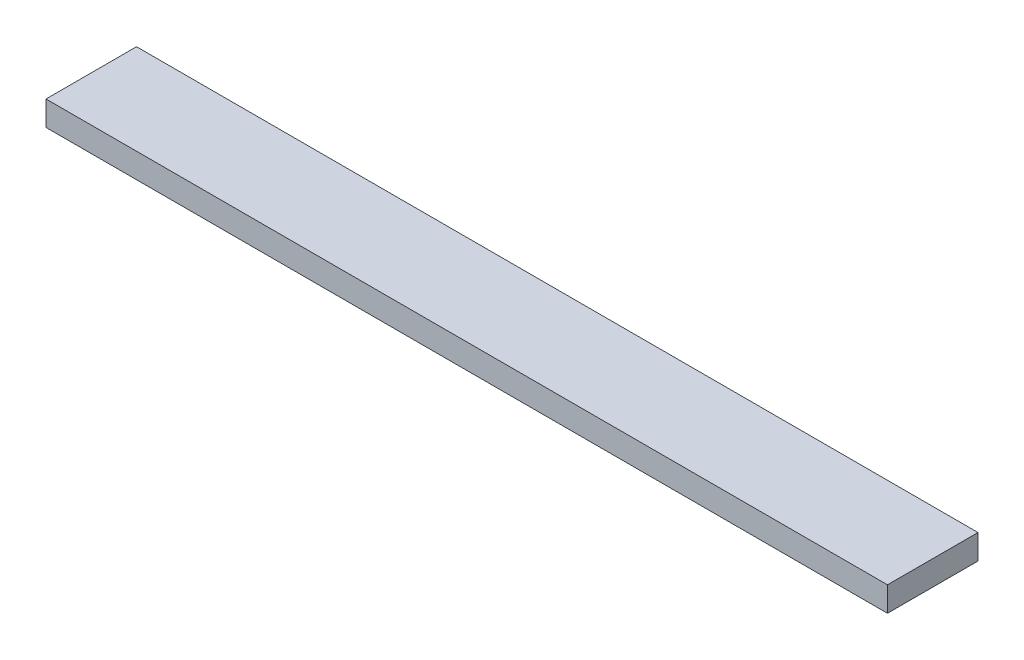
ISO-10303-21;
HEADER;
FILE_DESCRIPTION(('STEP AP214'),'2;1');
FILE_NAME('part.step','',(''),(''),'','','');
FILE_SCHEMA(('AUTOMOTIVE_DESIGN { 1 0 10303 214 1 1 1 1 }'));
ENDSEC;
DATA;
#1=APPLICATION_CONTEXT('core data for automotive mechanical design processes');
#2=APPLICATION_PROTOCOL_DEFINITION('international standard','automotive_design',2000,#1);
#3=PRODUCT_CONTEXT('',#1,'mechanical');
#4=PRODUCT('Part','Part','',(#3));
#5=PRODUCT_RELATED_PRODUCT_CATEGORY('part','',(#4));
#6=PRODUCT_DEFINITION_FORMATION('','',#4);
#7=PRODUCT_DEFINITION_CONTEXT('part definition',#1,'design');
#8=PRODUCT_DEFINITION('design','',#6,#7);
#9=PRODUCT_DEFINITION_SHAPE('','',#8);
#10=(LENGTH_UNIT() NAMED_UNIT(*) SI_UNIT(.MILLI.,.METRE.));
#11=(NAMED_UNIT(*) PLANE_ANGLE_UNIT() SI_UNIT($,.RADIAN.));
#12=(NAMED_UNIT(*) SI_UNIT($,.STERADIAN.) SOLID_ANGLE_UNIT());
#13=UNCERTAINTY_MEASURE_WITH_UNIT(LENGTH_MEASURE(1.E-05),#10,'distance_accuracy_value','');
#14=(GEOMETRIC_REPRESENTATION_CONTEXT(3) GLOBAL_UNCERTAINTY_ASSIGNED_CONTEXT((#13)) GLOBAL_UNIT_ASSIGNED_CONTEXT((#10,
#11,#12)) REPRESENTATION_CONTEXT('',''));
#15=CARTESIAN_POINT('',(0.,0.,0.));
#16=DIRECTION('',(0.,0.,1.));
#17=DIRECTION('',(1.,0.,0.));
#18=AXIS2_PLACEMENT_3D('',#15,#16,#17);
#19=CARTESIAN_POINT('',(0.,19.05,0.));
#20=DIRECTION('',(1.,0.,0.));
#21=DIRECTION('',(0.,0.,-1.));
#22=AXIS2_PLACEMENT_3D('',#19,#20,#21);
#23=PLANE('',#22);
#24=DIRECTION('',(0.,0.,1.));
#25=VECTOR('',#24,1.);
#26=CARTESIAN_POINT('',(0.,0.,0.));
#27=LINE('',#26,#25);
#28=CARTESIAN_POINT('',(0.,0.,-69.85));
#29=VERTEX_POINT('',#28);
#30=CARTESIAN_POINT('',(0.,0.,0.));
#31=VERTEX_POINT('',#30);
#32=EDGE_CURVE('E102',#29,#31,#27,.T.);
#33=ORIENTED_EDGE('',*,*,#32,.T.);
#34=DIRECTION('',(0.,-1.,0.));
#35=VECTOR('',#34,1.);
#36=CARTESIAN_POINT('',(0.,19.05,0.));
#37=LINE('',#36,#35);
#38=CARTESIAN_POINT('',(0.,19.05,0.));
#39=VERTEX_POINT('',#38);
#40=EDGE_CURVE('E11',#39,#31,#37,.T.);
#41=ORIENTED_EDGE('',*,*,#40,.F.);
#42=DIRECTION('',(0.,0.,1.));
#43=VECTOR('',#42,1.);
#44=CARTESIAN_POINT('',(0.,19.05,0.));
#45=LINE('',#44,#43);
#46=CARTESIAN_POINT('',(0.,19.05,-69.85));
#47=VERTEX_POINT('',#46);
#48=EDGE_CURVE('E90',#47,#39,#45,.T.);
#49=ORIENTED_EDGE('',*,*,#48,.F.);
#50=DIRECTION('',(0.,-1.,0.));
#51=VECTOR('',#50,1.);
#52=CARTESIAN_POINT('',(0.,19.05,-69.85));
#53=LINE('',#52,#51);
#54=EDGE_CURVE('E98',#47,#29,#53,.T.);
#55=ORIENTED_EDGE('',*,*,#54,.T.);
#56=EDGE_LOOP('',(#33,#41,#49,#55));
#57=FACE_BOUND('',#56,.T.);
#58=ADVANCED_FACE('F39',(#57),#23,.F.);
#59=CARTESIAN_POINT('',(0.,19.05,0.));
#60=DIRECTION('',(0.,0.,-1.));
#61=DIRECTION('',(-1.,0.,0.));
#62=AXIS2_PLACEMENT_3D('',#59,#60,#61);
#63=PLANE('',#62);
#64=DIRECTION('',(1.,0.,0.));
#65=VECTOR('',#64,1.);
#66=CARTESIAN_POINT('',(0.,0.,0.));
#67=LINE('',#66,#65);
#68=CARTESIAN_POINT('',(649.2875,0.,0.));
#69=VERTEX_POINT('',#68);
#70=EDGE_CURVE('E94',#31,#69,#67,.T.);
#71=ORIENTED_EDGE('',*,*,#70,.T.);
#72=DIRECTION('',(0.,-1.,0.));
#73=VECTOR('',#72,1.);
#74=CARTESIAN_POINT('',(649.2875,19.05,0.));
#75=LINE('',#74,#73);
#76=CARTESIAN_POINT('',(649.2875,19.05,0.));
#77=VERTEX_POINT('',#76);
#78=EDGE_CURVE('E47',#77,#69,#75,.T.);
#79=ORIENTED_EDGE('',*,*,#78,.F.);
#80=DIRECTION('',(1.,0.,0.));
#81=VECTOR('',#80,1.);
#82=CARTESIAN_POINT('',(0.,19.05,0.));
#83=LINE('',#82,#81);
#84=EDGE_CURVE('E85',#39,#77,#83,.T.);
#85=ORIENTED_EDGE('',*,*,#84,.F.);
#86=ORIENTED_EDGE('',*,*,#40,.T.);
#87=EDGE_LOOP('',(#71,#79,#85,#86));
#88=FACE_BOUND('',#87,.T.);
#89=ADVANCED_FACE('F93',(#88),#63,.F.);
#90=CARTESIAN_POINT('',(649.2875,19.05,0.));
#91=DIRECTION('',(-1.,0.,0.));
#92=DIRECTION('',(0.,0.,1.));
#93=AXIS2_PLACEMENT_3D('',#90,#91,#92);
#94=PLANE('',#93);
#95=DIRECTION('',(0.,0.,-1.));
#96=VECTOR('',#95,1.);
#97=CARTESIAN_POINT('',(649.2875,0.,0.));
#98=LINE('',#97,#96);
#99=CARTESIAN_POINT('',(649.2875,0.,-69.85));
#100=VERTEX_POINT('',#99);
#101=EDGE_CURVE('E72',#69,#100,#98,.T.);
#102=ORIENTED_EDGE('',*,*,#101,.T.);
#103=DIRECTION('',(0.,-1.,0.));
#104=VECTOR('',#103,1.);
#105=CARTESIAN_POINT('',(649.2875,19.05,-69.85));
#106=LINE('',#105,#104);
#107=CARTESIAN_POINT('',(649.2875,19.05,-69.85));
#108=VERTEX_POINT('',#107);
#109=EDGE_CURVE('E95',#108,#100,#106,.T.);
#110=ORIENTED_EDGE('',*,*,#109,.F.);
#111=DIRECTION('',(0.,0.,-1.));
#112=VECTOR('',#111,1.);
#113=CARTESIAN_POINT('',(649.2875,19.05,0.));
#114=LINE('',#113,#112);
#115=EDGE_CURVE('E88',#77,#108,#114,.T.);
#116=ORIENTED_EDGE('',*,*,#115,.F.);
#117=ORIENTED_EDGE('',*,*,#78,.T.);
#118=EDGE_LOOP('',(#102,#110,#116,#117));
#119=FACE_BOUND('',#118,.T.);
#120=ADVANCED_FACE('F96',(#119),#94,.F.);
#121=CARTESIAN_POINT('',(0.,19.05,-69.85));
#122=DIRECTION('',(0.,0.,1.));
#123=DIRECTION('',(1.,0.,0.));
#124=AXIS2_PLACEMENT_3D('',#121,#122,#123);
#125=PLANE('',#124);
#126=DIRECTION('',(-1.,0.,0.));
#127=VECTOR('',#126,1.);
#128=CARTESIAN_POINT('',(0.,0.,-69.85));
#129=LINE('',#128,#127);
#130=EDGE_CURVE('E78',#100,#29,#129,.T.);
#131=ORIENTED_EDGE('',*,*,#130,.T.);
#132=ORIENTED_EDGE('',*,*,#54,.F.);
#133=DIRECTION('',(-1.,0.,0.));
#134=VECTOR('',#133,1.);
#135=CARTESIAN_POINT('',(0.,19.05,-69.85));
#136=LINE('',#135,#134);
#137=EDGE_CURVE('E55',#108,#47,#136,.T.);
#138=ORIENTED_EDGE('',*,*,#137,.F.);
#139=ORIENTED_EDGE('',*,*,#109,.T.);
#140=EDGE_LOOP('',(#131,#132,#138,#139));
#141=FACE_BOUND('',#140,.T.);
#142=ADVANCED_FACE('F109',(#141),#125,.F.);
#143=CARTESIAN_POINT('',(0.,19.05,0.));
#144=DIRECTION('',(0.,-1.,0.));
#145=DIRECTION('',(0.,0.,-1.));
#146=AXIS2_PLACEMENT_3D('',#143,#144,#145);
#147=PLANE('',#146);
#148=ORIENTED_EDGE('',*,*,#48,.T.);
#149=ORIENTED_EDGE('',*,*,#84,.T.);
#150=ORIENTED_EDGE('',*,*,#115,.T.);
#151=ORIENTED_EDGE('',*,*,#137,.T.);
#152=EDGE_LOOP('',(#148,#149,#150,#151));
#153=FACE_BOUND('',#152,.T.);
#154=ADVANCED_FACE('F86',(#153),#147,.F.);
#155=CARTESIAN_POINT('',(0.,0.,0.));
#156=DIRECTION('',(0.,-1.,0.));
#157=DIRECTION('',(0.,0.,-1.));
#158=AXIS2_PLACEMENT_3D('',#155,#156,#157);
#159=PLANE('',#158);
#160=ORIENTED_EDGE('',*,*,#32,.F.);
#161=ORIENTED_EDGE('',*,*,#130,.F.);
#162=ORIENTED_EDGE('',*,*,#101,.F.);
#163=ORIENTED_EDGE('',*,*,#70,.F.);
#164=EDGE_LOOP('',(#160,#161,#162,#163));
#165=FACE_BOUND('',#164,.T.);
#166=ADVANCED_FACE('F112',(#165),#159,.T.);
#167=CLOSED_SHELL('',(#58,#89,#120,#142,#154,#166));
#168=MANIFOLD_SOLID_BREP('B2',#167);
#169=ADVANCED_BREP_SHAPE_REPRESENTATION('',(#18,#168),#14);
#170=SHAPE_DEFINITION_REPRESENTATION(#9,#169);
ENDSEC;
END-ISO-10303-21;
